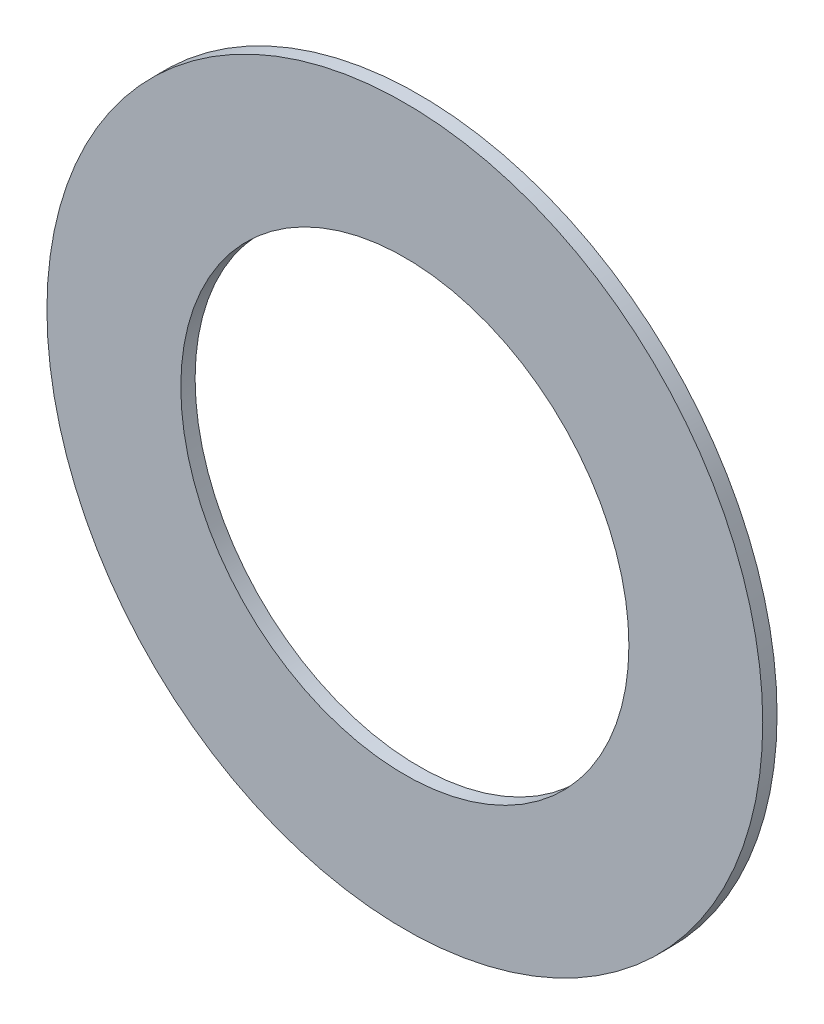
ISO-10303-21;
HEADER;
FILE_DESCRIPTION(('STEP AP214'),'2;1');
FILE_NAME('part.step','',(''),(''),'','','');
FILE_SCHEMA(('AUTOMOTIVE_DESIGN { 1 0 10303 214 1 1 1 1 }'));
ENDSEC;
DATA;
#1=APPLICATION_CONTEXT('core data for automotive mechanical design processes');
#2=APPLICATION_PROTOCOL_DEFINITION('international standard','automotive_design',2000,#1);
#3=PRODUCT_CONTEXT('',#1,'mechanical');
#4=PRODUCT('Part','Part','',(#3));
#5=PRODUCT_RELATED_PRODUCT_CATEGORY('part','',(#4));
#6=PRODUCT_DEFINITION_FORMATION('','',#4);
#7=PRODUCT_DEFINITION_CONTEXT('part definition',#1,'design');
#8=PRODUCT_DEFINITION('design','',#6,#7);
#9=PRODUCT_DEFINITION_SHAPE('','',#8);
#10=(LENGTH_UNIT() NAMED_UNIT(*) SI_UNIT(.MILLI.,.METRE.));
#11=(NAMED_UNIT(*) PLANE_ANGLE_UNIT() SI_UNIT($,.RADIAN.));
#12=(NAMED_UNIT(*) SI_UNIT($,.STERADIAN.) SOLID_ANGLE_UNIT());
#13=UNCERTAINTY_MEASURE_WITH_UNIT(LENGTH_MEASURE(1.E-05),#10,'distance_accuracy_value','');
#14=(GEOMETRIC_REPRESENTATION_CONTEXT(3) GLOBAL_UNCERTAINTY_ASSIGNED_CONTEXT((#13)) GLOBAL_UNIT_ASSIGNED_CONTEXT((#10,
#11,#12)) REPRESENTATION_CONTEXT('',''));
#15=CARTESIAN_POINT('',(0.,0.,0.));
#16=DIRECTION('',(0.,0.,1.));
#17=DIRECTION('',(1.,0.,0.));
#18=AXIS2_PLACEMENT_3D('',#15,#16,#17);
#19=CARTESIAN_POINT('',(0.,0.,0.254));
#20=DIRECTION('',(0.,0.,1.));
#21=DIRECTION('',(1.,0.,0.));
#22=AXIS2_PLACEMENT_3D('',#19,#20,#21);
#23=PLANE('',#22);
#24=CARTESIAN_POINT('',(0.,0.,0.254));
#25=DIRECTION('',(0.,0.,1.));
#26=DIRECTION('',(1.,0.,0.));
#27=AXIS2_PLACEMENT_3D('',#24,#25,#26);
#28=CIRCLE('',#27,6.35);
#29=CARTESIAN_POINT('',(6.35,0.,0.254));
#30=VERTEX_POINT('',#29);
#31=EDGE_CURVE('E10',#30,#30,#28,.T.);
#32=ORIENTED_EDGE('',*,*,#31,.T.);
#33=EDGE_LOOP('',(#32));
#34=FACE_BOUND('',#33,.T.);
#35=CARTESIAN_POINT('',(0.,0.,0.254));
#36=DIRECTION('',(0.,0.,1.));
#37=DIRECTION('',(1.,0.,0.));
#38=AXIS2_PLACEMENT_3D('',#35,#36,#37);
#39=CIRCLE('',#38,3.9751);
#40=CARTESIAN_POINT('',(3.9751,0.,0.254));
#41=VERTEX_POINT('',#40);
#42=EDGE_CURVE('E41',#41,#41,#39,.T.);
#43=ORIENTED_EDGE('',*,*,#42,.F.);
#44=EDGE_LOOP('',(#43));
#45=FACE_BOUND('',#44,.T.);
#46=ADVANCED_FACE('F30',(#34,#45),#23,.T.);
#47=CARTESIAN_POINT('',(0.,0.,0.));
#48=DIRECTION('',(0.,0.,1.));
#49=DIRECTION('',(1.,0.,0.));
#50=AXIS2_PLACEMENT_3D('',#47,#48,#49);
#51=PLANE('',#50);
#52=CARTESIAN_POINT('',(0.,0.,0.));
#53=DIRECTION('',(0.,0.,1.));
#54=DIRECTION('',(1.,0.,0.));
#55=AXIS2_PLACEMENT_3D('',#52,#53,#54);
#56=CIRCLE('',#55,6.35);
#57=CARTESIAN_POINT('',(6.35,0.,0.));
#58=VERTEX_POINT('',#57);
#59=EDGE_CURVE('E34',#58,#58,#56,.T.);
#60=ORIENTED_EDGE('',*,*,#59,.F.);
#61=EDGE_LOOP('',(#60));
#62=FACE_BOUND('',#61,.T.);
#63=CARTESIAN_POINT('',(0.,0.,0.));
#64=DIRECTION('',(0.,0.,1.));
#65=DIRECTION('',(1.,0.,0.));
#66=AXIS2_PLACEMENT_3D('',#63,#64,#65);
#67=CIRCLE('',#66,3.9751);
#68=CARTESIAN_POINT('',(3.9751,0.,0.));
#69=VERTEX_POINT('',#68);
#70=EDGE_CURVE('E43',#69,#69,#67,.T.);
#71=ORIENTED_EDGE('',*,*,#70,.T.);
#72=EDGE_LOOP('',(#71));
#73=FACE_BOUND('',#72,.T.);
#74=ADVANCED_FACE('F53',(#62,#73),#51,.F.);
#75=CARTESIAN_POINT('',(0.,0.,0.254));
#76=DIRECTION('',(0.,0.,-1.));
#77=DIRECTION('',(-1.,0.,0.));
#78=AXIS2_PLACEMENT_3D('',#75,#76,#77);
#79=CYLINDRICAL_SURFACE('',#78,6.35);
#80=ORIENTED_EDGE('',*,*,#31,.F.);
#81=EDGE_LOOP('',(#80));
#82=FACE_BOUND('',#81,.T.);
#83=ORIENTED_EDGE('',*,*,#59,.T.);
#84=EDGE_LOOP('',(#83));
#85=FACE_BOUND('',#84,.T.);
#86=ADVANCED_FACE('F32',(#82,#85),#79,.T.);
#87=CARTESIAN_POINT('',(0.,0.,0.254));
#88=DIRECTION('',(0.,0.,-1.));
#89=DIRECTION('',(-1.,0.,0.));
#90=AXIS2_PLACEMENT_3D('',#87,#88,#89);
#91=CYLINDRICAL_SURFACE('',#90,3.9751);
#92=ORIENTED_EDGE('',*,*,#42,.T.);
#93=EDGE_LOOP('',(#92));
#94=FACE_BOUND('',#93,.T.);
#95=ORIENTED_EDGE('',*,*,#70,.F.);
#96=EDGE_LOOP('',(#95));
#97=FACE_BOUND('',#96,.T.);
#98=ADVANCED_FACE('F49',(#94,#97),#91,.F.);
#99=CLOSED_SHELL('',(#46,#74,#86,#98));
#100=MANIFOLD_SOLID_BREP('B2',#99);
#101=ADVANCED_BREP_SHAPE_REPRESENTATION('',(#18,#100),#14);
#102=SHAPE_DEFINITION_REPRESENTATION(#9,#101);
ENDSEC;
END-ISO-10303-21;
